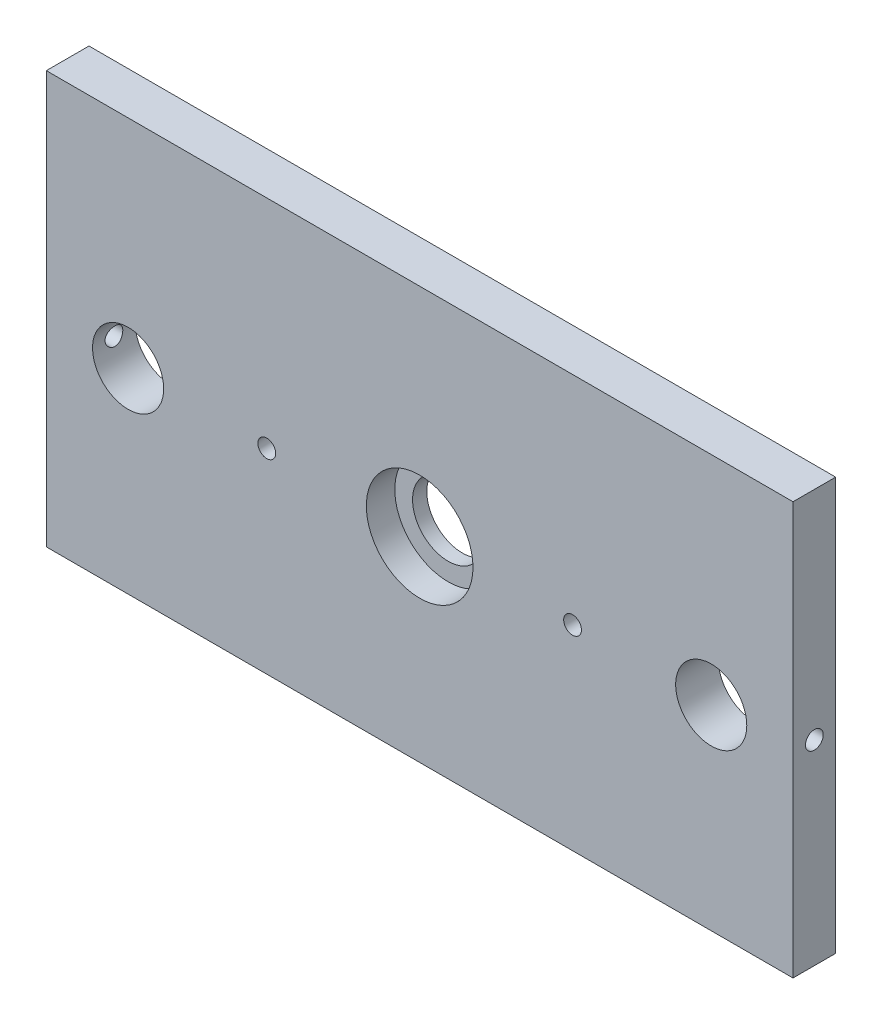
ISO-10303-21;
HEADER;
FILE_DESCRIPTION(('STEP AP214'),'2;1');
FILE_NAME('part.step','',(''),(''),'','','');
FILE_SCHEMA(('AUTOMOTIVE_DESIGN { 1 0 10303 214 1 1 1 1 }'));
ENDSEC;
DATA;
#1=APPLICATION_CONTEXT('core data for automotive mechanical design processes');
#2=APPLICATION_PROTOCOL_DEFINITION('international standard','automotive_design',2000,#1);
#3=PRODUCT_CONTEXT('',#1,'mechanical');
#4=PRODUCT('Part','Part','',(#3));
#5=PRODUCT_RELATED_PRODUCT_CATEGORY('part','',(#4));
#6=PRODUCT_DEFINITION_FORMATION('','',#4);
#7=PRODUCT_DEFINITION_CONTEXT('part definition',#1,'design');
#8=PRODUCT_DEFINITION('design','',#6,#7);
#9=PRODUCT_DEFINITION_SHAPE('','',#8);
#10=(LENGTH_UNIT() NAMED_UNIT(*) SI_UNIT(.MILLI.,.METRE.));
#11=(NAMED_UNIT(*) PLANE_ANGLE_UNIT() SI_UNIT($,.RADIAN.));
#12=(NAMED_UNIT(*) SI_UNIT($,.STERADIAN.) SOLID_ANGLE_UNIT());
#13=UNCERTAINTY_MEASURE_WITH_UNIT(LENGTH_MEASURE(1.E-05),#10,'distance_accuracy_value','');
#14=(GEOMETRIC_REPRESENTATION_CONTEXT(3) GLOBAL_UNCERTAINTY_ASSIGNED_CONTEXT((#13)) GLOBAL_UNIT_ASSIGNED_CONTEXT((#10,
#11,#12)) REPRESENTATION_CONTEXT('',''));
#15=CARTESIAN_POINT('',(0.,0.,0.));
#16=DIRECTION('',(0.,0.,1.));
#17=DIRECTION('',(1.,0.,0.));
#18=AXIS2_PLACEMENT_3D('',#15,#16,#17);
#19=CARTESIAN_POINT('',(105.,55.,-12.));
#20=DIRECTION('',(0.,0.,1.));
#21=DIRECTION('',(1.,0.,0.));
#22=AXIS2_PLACEMENT_3D('',#19,#20,#21);
#23=CYLINDRICAL_SURFACE('',#22,9.99999999999999);
#24=CARTESIAN_POINT('',(105.,55.,-12.));
#25=DIRECTION('',(0.,0.,1.));
#26=DIRECTION('',(1.,0.,0.));
#27=AXIS2_PLACEMENT_3D('',#24,#25,#26);
#28=CIRCLE('',#27,9.99999999999999);
#29=CARTESIAN_POINT('',(115.,55.,-12.));
#30=VERTEX_POINT('',#29);
#31=EDGE_CURVE('E129',#30,#30,#28,.T.);
#32=ORIENTED_EDGE('',*,*,#31,.F.);
#33=EDGE_LOOP('',(#32));
#34=FACE_BOUND('',#33,.T.);
#35=CARTESIAN_POINT('',(105.,55.,-8.));
#36=DIRECTION('',(0.,0.,1.));
#37=DIRECTION('',(1.,0.,0.));
#38=AXIS2_PLACEMENT_3D('',#35,#36,#37);
#39=CIRCLE('',#38,9.99999999999999);
#40=CARTESIAN_POINT('',(115.,55.,-8.));
#41=VERTEX_POINT('',#40);
#42=EDGE_CURVE('E38',#41,#41,#39,.F.);
#43=ORIENTED_EDGE('',*,*,#42,.F.);
#44=EDGE_LOOP('',(#43));
#45=FACE_BOUND('',#44,.T.);
#46=ADVANCED_FACE('F34',(#34,#45),#23,.F.);
#47=CARTESIAN_POINT('',(0.,116.,0.));
#48=DIRECTION('',(1.,0.,0.));
#49=DIRECTION('',(0.,0.,-1.));
#50=AXIS2_PLACEMENT_3D('',#47,#48,#49);
#51=PLANE('',#50);
#52=CARTESIAN_POINT('',(0.,55.,-6.));
#53=DIRECTION('',(-1.,0.,0.));
#54=DIRECTION('',(0.,0.,1.));
#55=AXIS2_PLACEMENT_3D('',#52,#53,#54);
#56=CIRCLE('',#55,2.5);
#57=CARTESIAN_POINT('',(0.,55.,-3.5));
#58=VERTEX_POINT('',#57);
#59=EDGE_CURVE('E136',#58,#58,#56,.T.);
#60=ORIENTED_EDGE('',*,*,#59,.F.);
#61=EDGE_LOOP('',(#60));
#62=FACE_BOUND('',#61,.T.);
#63=DIRECTION('',(0.,0.,1.));
#64=VECTOR('',#63,1.);
#65=CARTESIAN_POINT('',(0.,0.,0.));
#66=LINE('',#65,#64);
#67=CARTESIAN_POINT('',(0.,0.,-12.));
#68=VERTEX_POINT('',#67);
#69=CARTESIAN_POINT('',(0.,0.,0.));
#70=VERTEX_POINT('',#69);
#71=EDGE_CURVE('E150',#68,#70,#66,.T.);
#72=ORIENTED_EDGE('',*,*,#71,.T.);
#73=DIRECTION('',(0.,-1.,0.));
#74=VECTOR('',#73,1.);
#75=CARTESIAN_POINT('',(0.,116.,0.));
#76=LINE('',#75,#74);
#77=CARTESIAN_POINT('',(0.,116.,0.));
#78=VERTEX_POINT('',#77);
#79=EDGE_CURVE('E11',#78,#70,#76,.T.);
#80=ORIENTED_EDGE('',*,*,#79,.F.);
#81=DIRECTION('',(0.,0.,1.));
#82=VECTOR('',#81,1.);
#83=CARTESIAN_POINT('',(0.,116.,0.));
#84=LINE('',#83,#82);
#85=CARTESIAN_POINT('',(0.,116.,-12.));
#86=VERTEX_POINT('',#85);
#87=EDGE_CURVE('E153',#86,#78,#84,.T.);
#88=ORIENTED_EDGE('',*,*,#87,.F.);
#89=DIRECTION('',(0.,-1.,0.));
#90=VECTOR('',#89,1.);
#91=CARTESIAN_POINT('',(0.,116.,-12.));
#92=LINE('',#91,#90);
#93=EDGE_CURVE('E159',#86,#68,#92,.T.);
#94=ORIENTED_EDGE('',*,*,#93,.T.);
#95=EDGE_LOOP('',(#72,#80,#88,#94));
#96=FACE_BOUND('',#95,.T.);
#97=ADVANCED_FACE('F36',(#62,#96),#51,.F.);
#98=CARTESIAN_POINT('',(0.,116.,0.));
#99=DIRECTION('',(0.,0.,-1.));
#100=DIRECTION('',(-1.,0.,0.));
#101=AXIS2_PLACEMENT_3D('',#98,#99,#100);
#102=PLANE('',#101);
#103=CARTESIAN_POINT('',(148.,55.,0.));
#104=DIRECTION('',(0.,0.,-1.));
#105=DIRECTION('',(-1.,0.,0.));
#106=AXIS2_PLACEMENT_3D('',#103,#104,#105);
#107=CIRCLE('',#106,2.49999999999999);
#108=CARTESIAN_POINT('',(145.5,55.,0.));
#109=VERTEX_POINT('',#108);
#110=EDGE_CURVE('E253',#109,#109,#107,.T.);
#111=ORIENTED_EDGE('',*,*,#110,.T.);
#112=EDGE_LOOP('',(#111));
#113=FACE_BOUND('',#112,.T.);
#114=CARTESIAN_POINT('',(62.,55.,0.));
#115=DIRECTION('',(0.,0.,-1.));
#116=DIRECTION('',(-1.,0.,0.));
#117=AXIS2_PLACEMENT_3D('',#114,#115,#116);
#118=CIRCLE('',#117,2.49999999999999);
#119=CARTESIAN_POINT('',(59.5,55.,0.));
#120=VERTEX_POINT('',#119);
#121=EDGE_CURVE('E111',#120,#120,#118,.T.);
#122=ORIENTED_EDGE('',*,*,#121,.T.);
#123=EDGE_LOOP('',(#122));
#124=FACE_BOUND('',#123,.T.);
#125=CARTESIAN_POINT('',(105.,55.,0.));
#126=DIRECTION('',(0.,0.,1.));
#127=DIRECTION('',(1.,0.,0.));
#128=AXIS2_PLACEMENT_3D('',#125,#126,#127);
#129=CIRCLE('',#128,15.);
#130=CARTESIAN_POINT('',(120.,55.,0.));
#131=VERTEX_POINT('',#130);
#132=EDGE_CURVE('E123',#131,#131,#129,.T.);
#133=ORIENTED_EDGE('',*,*,#132,.F.);
#134=EDGE_LOOP('',(#133));
#135=FACE_BOUND('',#134,.T.);
#136=CARTESIAN_POINT('',(187.,55.,0.));
#137=DIRECTION('',(0.,0.,1.));
#138=DIRECTION('',(1.,0.,0.));
#139=AXIS2_PLACEMENT_3D('',#136,#137,#138);
#140=CIRCLE('',#139,10.);
#141=CARTESIAN_POINT('',(197.,55.,0.));
#142=VERTEX_POINT('',#141);
#143=EDGE_CURVE('E144',#142,#142,#140,.T.);
#144=ORIENTED_EDGE('',*,*,#143,.F.);
#145=EDGE_LOOP('',(#144));
#146=FACE_BOUND('',#145,.T.);
#147=CARTESIAN_POINT('',(23.,55.,0.));
#148=DIRECTION('',(0.,0.,1.));
#149=DIRECTION('',(1.,0.,0.));
#150=AXIS2_PLACEMENT_3D('',#147,#148,#149);
#151=CIRCLE('',#150,10.);
#152=CARTESIAN_POINT('',(33.,55.,0.));
#153=VERTEX_POINT('',#152);
#154=EDGE_CURVE('E143',#153,#153,#151,.T.);
#155=ORIENTED_EDGE('',*,*,#154,.F.);
#156=EDGE_LOOP('',(#155));
#157=FACE_BOUND('',#156,.T.);
#158=DIRECTION('',(1.,0.,0.));
#159=VECTOR('',#158,1.);
#160=CARTESIAN_POINT('',(0.,0.,0.));
#161=LINE('',#160,#159);
#162=CARTESIAN_POINT('',(210.,0.,0.));
#163=VERTEX_POINT('',#162);
#164=EDGE_CURVE('E162',#70,#163,#161,.T.);
#165=ORIENTED_EDGE('',*,*,#164,.T.);
#166=DIRECTION('',(0.,-1.,0.));
#167=VECTOR('',#166,1.);
#168=CARTESIAN_POINT('',(210.,116.,0.));
#169=LINE('',#168,#167);
#170=CARTESIAN_POINT('',(210.,116.,0.));
#171=VERTEX_POINT('',#170);
#172=EDGE_CURVE('E44',#171,#163,#169,.T.);
#173=ORIENTED_EDGE('',*,*,#172,.F.);
#174=DIRECTION('',(1.,0.,0.));
#175=VECTOR('',#174,1.);
#176=CARTESIAN_POINT('',(0.,116.,0.));
#177=LINE('',#176,#175);
#178=EDGE_CURVE('E84',#78,#171,#177,.T.);
#179=ORIENTED_EDGE('',*,*,#178,.F.);
#180=ORIENTED_EDGE('',*,*,#79,.T.);
#181=EDGE_LOOP('',(#165,#173,#179,#180));
#182=FACE_BOUND('',#181,.T.);
#183=ADVANCED_FACE('F208',(#113,#124,#135,#146,#157,#182),#102,.F.);
#184=CARTESIAN_POINT('',(210.,116.,0.));
#185=DIRECTION('',(-1.,0.,0.));
#186=DIRECTION('',(0.,0.,1.));
#187=AXIS2_PLACEMENT_3D('',#184,#185,#186);
#188=PLANE('',#187);
#189=CARTESIAN_POINT('',(210.,55.,-6.));
#190=DIRECTION('',(1.,0.,0.));
#191=DIRECTION('',(0.,0.,-1.));
#192=AXIS2_PLACEMENT_3D('',#189,#190,#191);
#193=CIRCLE('',#192,2.49999999999999);
#194=CARTESIAN_POINT('',(210.,55.,-8.49999999999999));
#195=VERTEX_POINT('',#194);
#196=EDGE_CURVE('E132',#195,#195,#193,.T.);
#197=ORIENTED_EDGE('',*,*,#196,.F.);
#198=EDGE_LOOP('',(#197));
#199=FACE_BOUND('',#198,.T.);
#200=DIRECTION('',(0.,0.,-1.));
#201=VECTOR('',#200,1.);
#202=CARTESIAN_POINT('',(210.,0.,0.));
#203=LINE('',#202,#201);
#204=CARTESIAN_POINT('',(210.,0.,-12.));
#205=VERTEX_POINT('',#204);
#206=EDGE_CURVE('E71',#163,#205,#203,.T.);
#207=ORIENTED_EDGE('',*,*,#206,.T.);
#208=DIRECTION('',(0.,-1.,0.));
#209=VECTOR('',#208,1.);
#210=CARTESIAN_POINT('',(210.,116.,-12.));
#211=LINE('',#210,#209);
#212=CARTESIAN_POINT('',(210.,116.,-12.));
#213=VERTEX_POINT('',#212);
#214=EDGE_CURVE('E167',#213,#205,#211,.T.);
#215=ORIENTED_EDGE('',*,*,#214,.F.);
#216=DIRECTION('',(0.,0.,-1.));
#217=VECTOR('',#216,1.);
#218=CARTESIAN_POINT('',(210.,116.,0.));
#219=LINE('',#218,#217);
#220=EDGE_CURVE('E156',#171,#213,#219,.T.);
#221=ORIENTED_EDGE('',*,*,#220,.F.);
#222=ORIENTED_EDGE('',*,*,#172,.T.);
#223=EDGE_LOOP('',(#207,#215,#221,#222));
#224=FACE_BOUND('',#223,.T.);
#225=ADVANCED_FACE('F266',(#199,#224),#188,.F.);
#226=CARTESIAN_POINT('',(0.,116.,-12.));
#227=DIRECTION('',(0.,0.,1.));
#228=DIRECTION('',(1.,0.,0.));
#229=AXIS2_PLACEMENT_3D('',#226,#227,#228);
#230=PLANE('',#229);
#231=CARTESIAN_POINT('',(148.,55.,-12.));
#232=DIRECTION('',(0.,0.,-1.));
#233=DIRECTION('',(-1.,0.,0.));
#234=AXIS2_PLACEMENT_3D('',#231,#232,#233);
#235=CIRCLE('',#234,2.5);
#236=CARTESIAN_POINT('',(145.5,55.,-12.));
#237=VERTEX_POINT('',#236);
#238=EDGE_CURVE('E250',#237,#237,#235,.T.);
#239=ORIENTED_EDGE('',*,*,#238,.F.);
#240=EDGE_LOOP('',(#239));
#241=FACE_BOUND('',#240,.T.);
#242=CARTESIAN_POINT('',(62.,55.,-12.));
#243=DIRECTION('',(0.,0.,-1.));
#244=DIRECTION('',(-1.,0.,0.));
#245=AXIS2_PLACEMENT_3D('',#242,#243,#244);
#246=CIRCLE('',#245,2.49999999999999);
#247=CARTESIAN_POINT('',(59.5,55.,-12.));
#248=VERTEX_POINT('',#247);
#249=EDGE_CURVE('E255',#248,#248,#246,.T.);
#250=ORIENTED_EDGE('',*,*,#249,.F.);
#251=EDGE_LOOP('',(#250));
#252=FACE_BOUND('',#251,.T.);
#253=ORIENTED_EDGE('',*,*,#31,.T.);
#254=EDGE_LOOP('',(#253));
#255=FACE_BOUND('',#254,.T.);
#256=CARTESIAN_POINT('',(187.,55.,-12.));
#257=DIRECTION('',(0.,0.,1.));
#258=DIRECTION('',(1.,0.,0.));
#259=AXIS2_PLACEMENT_3D('',#256,#257,#258);
#260=CIRCLE('',#259,10.);
#261=CARTESIAN_POINT('',(197.,55.,-12.));
#262=VERTEX_POINT('',#261);
#263=EDGE_CURVE('E140',#262,#262,#260,.T.);
#264=ORIENTED_EDGE('',*,*,#263,.T.);
#265=EDGE_LOOP('',(#264));
#266=FACE_BOUND('',#265,.T.);
#267=CARTESIAN_POINT('',(23.,55.,-12.));
#268=DIRECTION('',(0.,0.,1.));
#269=DIRECTION('',(1.,0.,0.));
#270=AXIS2_PLACEMENT_3D('',#267,#268,#269);
#271=CIRCLE('',#270,10.);
#272=CARTESIAN_POINT('',(33.,55.,-12.));
#273=VERTEX_POINT('',#272);
#274=EDGE_CURVE('E147',#273,#273,#271,.T.);
#275=ORIENTED_EDGE('',*,*,#274,.T.);
#276=EDGE_LOOP('',(#275));
#277=FACE_BOUND('',#276,.T.);
#278=DIRECTION('',(-1.,0.,0.));
#279=VECTOR('',#278,1.);
#280=CARTESIAN_POINT('',(0.,0.,-12.));
#281=LINE('',#280,#279);
#282=EDGE_CURVE('E77',#205,#68,#281,.T.);
#283=ORIENTED_EDGE('',*,*,#282,.T.);
#284=ORIENTED_EDGE('',*,*,#93,.F.);
#285=DIRECTION('',(-1.,0.,0.));
#286=VECTOR('',#285,1.);
#287=CARTESIAN_POINT('',(0.,116.,-12.));
#288=LINE('',#287,#286);
#289=EDGE_CURVE('E53',#213,#86,#288,.T.);
#290=ORIENTED_EDGE('',*,*,#289,.F.);
#291=ORIENTED_EDGE('',*,*,#214,.T.);
#292=EDGE_LOOP('',(#283,#284,#290,#291));
#293=FACE_BOUND('',#292,.T.);
#294=ADVANCED_FACE('F278',(#241,#252,#255,#266,#277,#293),#230,.F.);
#295=CARTESIAN_POINT('',(0.,116.,0.));
#296=DIRECTION('',(0.,-1.,0.));
#297=DIRECTION('',(0.,0.,-1.));
#298=AXIS2_PLACEMENT_3D('',#295,#296,#297);
#299=PLANE('',#298);
#300=ORIENTED_EDGE('',*,*,#87,.T.);
#301=ORIENTED_EDGE('',*,*,#178,.T.);
#302=ORIENTED_EDGE('',*,*,#220,.T.);
#303=ORIENTED_EDGE('',*,*,#289,.T.);
#304=EDGE_LOOP('',(#300,#301,#302,#303));
#305=FACE_BOUND('',#304,.T.);
#306=ADVANCED_FACE('F280',(#305),#299,.F.);
#307=CARTESIAN_POINT('',(0.,0.,0.));
#308=DIRECTION('',(0.,-1.,0.));
#309=DIRECTION('',(0.,0.,-1.));
#310=AXIS2_PLACEMENT_3D('',#307,#308,#309);
#311=PLANE('',#310);
#312=CARTESIAN_POINT('',(25.,0.,-6.));
#313=DIRECTION('',(0.,-1.,0.));
#314=DIRECTION('',(0.,0.,-1.));
#315=AXIS2_PLACEMENT_3D('',#312,#313,#314);
#316=CIRCLE('',#315,2.49999999999999);
#317=CARTESIAN_POINT('',(25.,0.,-8.49999999999999));
#318=VERTEX_POINT('',#317);
#319=EDGE_CURVE('E105',#318,#318,#316,.T.);
#320=ORIENTED_EDGE('',*,*,#319,.F.);
#321=EDGE_LOOP('',(#320));
#322=FACE_BOUND('',#321,.T.);
#323=CARTESIAN_POINT('',(105.,0.,-6.));
#324=DIRECTION('',(0.,-1.,0.));
#325=DIRECTION('',(0.,0.,-1.));
#326=AXIS2_PLACEMENT_3D('',#323,#324,#325);
#327=CIRCLE('',#326,2.49999999999999);
#328=CARTESIAN_POINT('',(105.,0.,-8.49999999999999));
#329=VERTEX_POINT('',#328);
#330=EDGE_CURVE('E104',#329,#329,#327,.T.);
#331=ORIENTED_EDGE('',*,*,#330,.F.);
#332=EDGE_LOOP('',(#331));
#333=FACE_BOUND('',#332,.T.);
#334=CARTESIAN_POINT('',(185.,0.,-6.));
#335=DIRECTION('',(0.,-1.,0.));
#336=DIRECTION('',(0.,0.,-1.));
#337=AXIS2_PLACEMENT_3D('',#334,#335,#336);
#338=CIRCLE('',#337,2.5);
#339=CARTESIAN_POINT('',(185.,0.,-8.5));
#340=VERTEX_POINT('',#339);
#341=EDGE_CURVE('E117',#340,#340,#338,.T.);
#342=ORIENTED_EDGE('',*,*,#341,.F.);
#343=EDGE_LOOP('',(#342));
#344=FACE_BOUND('',#343,.T.);
#345=ORIENTED_EDGE('',*,*,#71,.F.);
#346=ORIENTED_EDGE('',*,*,#282,.F.);
#347=ORIENTED_EDGE('',*,*,#206,.F.);
#348=ORIENTED_EDGE('',*,*,#164,.F.);
#349=EDGE_LOOP('',(#345,#346,#347,#348));
#350=FACE_BOUND('',#349,.T.);
#351=ADVANCED_FACE('F198',(#322,#333,#344,#350),#311,.T.);
#352=CARTESIAN_POINT('',(23.,55.,-12.));
#353=DIRECTION('',(0.,0.,1.));
#354=DIRECTION('',(1.,0.,0.));
#355=AXIS2_PLACEMENT_3D('',#352,#353,#354);
#356=CYLINDRICAL_SURFACE('',#355,10.);
#357=CARTESIAN_POINT('',(13.,55.,-3.5));
#358=CARTESIAN_POINT('',(13.0000023355331,55.1381268144495,-3.50000387623027));
#359=CARTESIAN_POINT('',(13.0028903644696,55.2762969297179,-3.51148591795631));
#360=CARTESIAN_POINT('',(13.0141314361684,55.5486772062842,-3.55704191884501));
#361=CARTESIAN_POINT('',(13.0224875763337,55.6828850781179,-3.59112868256309));
#362=CARTESIAN_POINT('',(13.0437395611328,55.9433681203043,-3.68073208910348));
#363=CARTESIAN_POINT('',(13.0566299526324,56.0696526057167,-3.73622299785878));
#364=CARTESIAN_POINT('',(13.0855776032063,56.3111202198407,-3.86696898340807));
#365=CARTESIAN_POINT('',(13.1016349690974,56.4263029739146,-3.94222472686495));
#366=CARTESIAN_POINT('',(13.1355431068051,56.6446698788349,-4.1120013160903));
#367=CARTESIAN_POINT('',(13.1534215475312,56.7475928167684,-4.20685262493176));
#368=CARTESIAN_POINT('',(13.1887729980344,56.9362482120055,-4.41242034151505));
#369=CARTESIAN_POINT('',(13.2062459618355,57.0219787282486,-4.52313853824489));
#370=CARTESIAN_POINT('',(13.2390870716972,57.1750442379983,-4.75932537789498));
#371=CARTESIAN_POINT('',(13.2544200922531,57.2420870265419,-4.88498871801454));
#372=CARTESIAN_POINT('',(13.2808417530331,57.3539948475846,-5.14624735276672));
#373=CARTESIAN_POINT('',(13.2919310717597,57.3988634257336,-5.28184105555336));
#374=CARTESIAN_POINT('',(13.3083253883946,57.4642580613413,-5.55623916366943));
#375=CARTESIAN_POINT('',(13.3137418167165,57.4852537805534,-5.69492482672998));
#376=CARTESIAN_POINT('',(13.3185106256735,57.5037696251107,-5.97394761499891));
#377=CARTESIAN_POINT('',(13.3178639928679,57.5012935696969,-6.11428446782023));
#378=CARTESIAN_POINT('',(13.310679908053,57.4733108743995,-6.38902634624225));
#379=CARTESIAN_POINT('',(13.3042856165451,57.4483639003177,-6.52349270244221));
#380=CARTESIAN_POINT('',(13.2865548388155,57.377040311505,-6.78626841818509));
#381=CARTESIAN_POINT('',(13.2752180005127,57.3306621701157,-6.91457733838153));
#382=CARTESIAN_POINT('',(13.2487481015723,57.217315796562,-7.16289669375354));
#383=CARTESIAN_POINT('',(13.2335778755031,57.1501444453882,-7.28281028631594));
#384=CARTESIAN_POINT('',(13.2011714859001,56.9972604600249,-7.50986451626136));
#385=CARTESIAN_POINT('',(13.1839349610895,56.9115445813481,-7.61700291344541));
#386=CARTESIAN_POINT('',(13.1487353243351,56.721105707802,-7.81867269282401));
#387=CARTESIAN_POINT('',(13.1307655087,56.6159104302764,-7.91275748343558));
#388=CARTESIAN_POINT('',(13.0965672403541,56.3910198625062,-8.0820354041065));
#389=CARTESIAN_POINT('',(13.0803388408432,56.2713241295132,-8.15722795710594));
#390=CARTESIAN_POINT('',(13.0513711317635,56.0201931478023,-8.28675097704064));
#391=CARTESIAN_POINT('',(13.0386439978712,55.888718988681,-8.34100890042404));
#392=CARTESIAN_POINT('',(13.0182013834764,55.6181266802381,-8.42652884284929));
#393=CARTESIAN_POINT('',(13.0104849443453,55.4790099985841,-8.4577952606969));
#394=CARTESIAN_POINT('',(13.0010750121438,55.20089995065,-8.49576260926473));
#395=CARTESIAN_POINT('',(12.9992324415287,55.0619945333137,-8.5030717101255));
#396=CARTESIAN_POINT('',(13.0013532530925,54.7849452086641,-8.49458499657418));
#397=CARTESIAN_POINT('',(13.0053161126358,54.6468012339257,-8.47879126200143));
#398=CARTESIAN_POINT('',(13.0185069812108,54.3773095520392,-8.42504848601437));
#399=CARTESIAN_POINT('',(13.0276560969035,54.2458914683854,-8.38743122753838));
#400=CARTESIAN_POINT('',(13.050188222764,53.9912378459125,-8.2914881932859));
#401=CARTESIAN_POINT('',(13.0635716605003,53.8680031349456,-8.23316032614463));
#402=CARTESIAN_POINT('',(13.0934448678963,53.6307947759503,-8.09627311854221));
#403=CARTESIAN_POINT('',(13.10998554389,53.5170242636071,-8.01737314600573));
#404=CARTESIAN_POINT('',(13.1442581802041,53.3041223105945,-7.84201681867139));
#405=CARTESIAN_POINT('',(13.1619903457842,53.2049934017113,-7.74555743397059));
#406=CARTESIAN_POINT('',(13.197184050675,53.0216823865459,-7.53499673192716));
#407=CARTESIAN_POINT('',(13.2146282636254,52.9379268872982,-7.42052049500073));
#408=CARTESIAN_POINT('',(13.2467853602993,52.790815401644,-7.17877894255237));
#409=CARTESIAN_POINT('',(13.2614983652506,52.727458509731,-7.05151419504927));
#410=CARTESIAN_POINT('',(13.2863650880533,52.6234142989878,-6.78849046265628));
#411=CARTESIAN_POINT('',(13.2965457462419,52.5825926722607,-6.65278728614618));
#412=CARTESIAN_POINT('',(13.3112209329341,52.5244239000951,-6.37615060357451));
#413=CARTESIAN_POINT('',(13.3157167049596,52.5070716208735,-6.23521824829759));
#414=CARTESIAN_POINT('',(13.3184183129839,52.4966023494392,-5.95646496023066));
#415=CARTESIAN_POINT('',(13.3168011211197,52.5028035036987,-5.81867094145593));
#416=CARTESIAN_POINT('',(13.3078681832786,52.5377045361463,-5.54616018555623));
#417=CARTESIAN_POINT('',(13.3005525518227,52.566403962189,-5.41144338664468));
#418=CARTESIAN_POINT('',(13.2811456552678,52.6451144675951,-5.14965256822356));
#419=CARTESIAN_POINT('',(13.2690830793894,52.694997658866,-5.02253782459945));
#420=CARTESIAN_POINT('',(13.2415374045916,52.814558477325,-4.77839102881072));
#421=CARTESIAN_POINT('',(13.2260538313219,52.884238849943,-4.66136037802186));
#422=CARTESIAN_POINT('',(13.1929060956066,53.0435537522714,-4.43740895166324));
#423=CARTESIAN_POINT('',(13.175195586137,53.1336613951462,-4.33083154429339));
#424=CARTESIAN_POINT('',(13.1398662125623,53.3303510480171,-4.13408825867434));
#425=CARTESIAN_POINT('',(13.1222473712158,53.4369369645648,-4.04392628314506));
#426=CARTESIAN_POINT('',(13.0887057392055,53.6658873554957,-3.88098115239232));
#427=CARTESIAN_POINT('',(13.0728194439022,53.7885026294727,-3.80854231054737));
#428=CARTESIAN_POINT('',(13.0449179170814,54.0445565674825,-3.68542089509912));
#429=CARTESIAN_POINT('',(13.032899913337,54.1779873942721,-3.63472273225244));
#430=CARTESIAN_POINT('',(13.0158656739076,54.4259829112609,-3.56404694945058));
#431=CARTESIAN_POINT('',(13.0099569157885,54.5393663818199,-3.54008126157761));
#432=CARTESIAN_POINT('',(13.0020232461342,54.7684898807729,-3.5080567606301));
#433=CARTESIAN_POINT('',(12.9999980424851,54.8842297312623,-3.49999675115783));
#434=CARTESIAN_POINT('',(13.,55.,-3.5));
#435=B_SPLINE_CURVE_WITH_KNOTS('',3,(#357,#358,#359,#360,#361,#362,#363,#364,#365,#366,#367,
#368,#369,#370,#371,#372,#373,#374,#375,#376,#377,#378,#379,#380,#381,#382,#383,#384,#385,#386,
#387,#388,#389,#390,#391,#392,#393,#394,#395,#396,#397,#398,#399,#400,#401,#402,#403,#404,#405,
#406,#407,#408,#409,#410,#411,#412,#413,#414,#415,#416,#417,#418,#419,#420,#421,#422,#423,#424,
#425,#426,#427,#428,#429,#430,#431,#432,#433,#434),.UNSPECIFIED.,.T.,.F.,(4,2,2,2,2,2,2,2,2,2,2,
2,2,2,2,2,2,2,2,2,2,2,2,2,2,2,2,2,2,2,2,2,2,2,2,2,2,2,4),(0.,0.413956187453143,
0.828147062939829,1.24184150381018,1.65554990028221,2.07690725728564,2.49831215966769,
2.92597745909678,3.3535743528228,3.77260491835116,4.19156730193362,4.60037495017231,
5.00921172448931,5.42217546461999,5.83521151399138,6.26002501620566,6.68485149269279,
7.11113715020724,7.53734122819939,7.95263848254329,8.36789835193439,8.77700457528929,
9.18615212209351,9.60255979281121,10.0190393835223,10.4457418201299,10.8724253125471,
11.2965375769763,11.7205570543048,12.1323963400748,12.5442273493652,12.9536066760887,
13.3630428023796,13.7831596069298,14.2033761629382,14.6312030917578,15.0587227304538,
15.4057040491338,15.7526592674819),.UNSPECIFIED.);
#436=CARTESIAN_POINT('',(13.,55.,-3.5));
#437=VERTEX_POINT('',#436);
#438=EDGE_CURVE('E139',#437,#437,#435,.T.);
#439=ORIENTED_EDGE('',*,*,#438,.T.);
#440=EDGE_LOOP('',(#439));
#441=FACE_BOUND('',#440,.T.);
#442=ORIENTED_EDGE('',*,*,#274,.F.);
#443=EDGE_LOOP('',(#442));
#444=FACE_BOUND('',#443,.T.);
#445=ORIENTED_EDGE('',*,*,#154,.T.);
#446=EDGE_LOOP('',(#445));
#447=FACE_BOUND('',#446,.T.);
#448=ADVANCED_FACE('F179',(#441,#444,#447),#356,.F.);
#449=CARTESIAN_POINT('',(187.,55.,-12.));
#450=DIRECTION('',(0.,0.,1.));
#451=DIRECTION('',(1.,0.,0.));
#452=AXIS2_PLACEMENT_3D('',#449,#450,#451);
#453=CYLINDRICAL_SURFACE('',#452,10.);
#454=CARTESIAN_POINT('',(197.,55.,-8.49999999999999));
#455=CARTESIAN_POINT('',(196.999997664467,55.1381268144495,-8.49999612376973));
#456=CARTESIAN_POINT('',(196.99710963553,55.2762969297179,-8.48851408204368));
#457=CARTESIAN_POINT('',(196.985868563832,55.5486772062842,-8.44295808115498));
#458=CARTESIAN_POINT('',(196.977512423666,55.6828850781179,-8.40887131743691));
#459=CARTESIAN_POINT('',(196.956260438867,55.9433681203043,-8.31926791089652));
#460=CARTESIAN_POINT('',(196.943370047368,56.0696526057167,-8.26377700214121));
#461=CARTESIAN_POINT('',(196.914422396794,56.3111202198407,-8.13303101659192));
#462=CARTESIAN_POINT('',(196.898365030903,56.4263029739146,-8.05777527313505));
#463=CARTESIAN_POINT('',(196.864456893195,56.6446698788349,-7.88799868390969));
#464=CARTESIAN_POINT('',(196.846578452469,56.7475928167684,-7.79314737506823));
#465=CARTESIAN_POINT('',(196.811227001966,56.9362482120055,-7.58757965848494));
#466=CARTESIAN_POINT('',(196.793754038164,57.0219787282486,-7.47686146175511));
#467=CARTESIAN_POINT('',(196.760912928303,57.1750442379983,-7.24067462210502));
#468=CARTESIAN_POINT('',(196.745579907747,57.2420870265419,-7.11501128198545));
#469=CARTESIAN_POINT('',(196.719158246967,57.3539948475846,-6.85375264723327));
#470=CARTESIAN_POINT('',(196.70806892824,57.3988634257336,-6.71815894444664));
#471=CARTESIAN_POINT('',(196.691674611605,57.4642580613413,-6.44376083633056));
#472=CARTESIAN_POINT('',(196.686258183284,57.4852537805534,-6.30507517327001));
#473=CARTESIAN_POINT('',(196.681489374327,57.5037696251107,-6.02605238500109));
#474=CARTESIAN_POINT('',(196.682136007132,57.5012935696968,-5.88571553217977));
#475=CARTESIAN_POINT('',(196.689320091947,57.4733108743995,-5.61097365375775));
#476=CARTESIAN_POINT('',(196.695714383455,57.4483639003177,-5.47650729755778));
#477=CARTESIAN_POINT('',(196.713445161184,57.377040311505,-5.2137315818149));
#478=CARTESIAN_POINT('',(196.724781999487,57.3306621701156,-5.08542266161847));
#479=CARTESIAN_POINT('',(196.751251898428,57.217315796562,-4.83710330624645));
#480=CARTESIAN_POINT('',(196.766422124497,57.1501444453882,-4.71718971368405));
#481=CARTESIAN_POINT('',(196.7988285141,56.9972604600249,-4.49013548373863));
#482=CARTESIAN_POINT('',(196.81606503891,56.9115445813481,-4.38299708655458));
#483=CARTESIAN_POINT('',(196.851264675665,56.721105707802,-4.181327307176));
#484=CARTESIAN_POINT('',(196.8692344913,56.6159104302764,-4.08724251656442));
#485=CARTESIAN_POINT('',(196.903432759646,56.3910198625062,-3.9179645958935));
#486=CARTESIAN_POINT('',(196.919661159157,56.2713241295132,-3.84277204289406));
#487=CARTESIAN_POINT('',(196.948628868237,56.0201931478023,-3.71324902295936));
#488=CARTESIAN_POINT('',(196.961356002129,55.888718988681,-3.65899109957596));
#489=CARTESIAN_POINT('',(196.981798616524,55.6181266802381,-3.57347115715072));
#490=CARTESIAN_POINT('',(196.989515055655,55.4790099985841,-3.54220473930311));
#491=CARTESIAN_POINT('',(196.998924987856,55.20089995065,-3.50423739073528));
#492=CARTESIAN_POINT('',(197.000767558471,55.0619945333137,-3.4969282898745));
#493=CARTESIAN_POINT('',(196.998646746908,54.7849452086641,-3.50541500342582));
#494=CARTESIAN_POINT('',(196.994683887364,54.6468012339257,-3.52120873799857));
#495=CARTESIAN_POINT('',(196.981493018789,54.3773095520392,-3.57495151398563));
#496=CARTESIAN_POINT('',(196.972343903096,54.2458914683854,-3.61256877246163));
#497=CARTESIAN_POINT('',(196.949811777236,53.9912378459125,-3.70851180671411));
#498=CARTESIAN_POINT('',(196.9364283395,53.8680031349456,-3.76683967385538));
#499=CARTESIAN_POINT('',(196.906555132104,53.6307947759503,-3.9037268814578));
#500=CARTESIAN_POINT('',(196.89001445611,53.5170242636071,-3.98262685399428));
#501=CARTESIAN_POINT('',(196.855741819796,53.3041223105945,-4.15798318132862));
#502=CARTESIAN_POINT('',(196.838009654216,53.2049934017113,-4.25444256602942));
#503=CARTESIAN_POINT('',(196.802815949325,53.0216823865459,-4.46500326807285));
#504=CARTESIAN_POINT('',(196.785371736375,52.9379268872982,-4.57947950499927));
#505=CARTESIAN_POINT('',(196.753214639701,52.790815401644,-4.82122105744764));
#506=CARTESIAN_POINT('',(196.738501634749,52.727458509731,-4.94848580495074));
#507=CARTESIAN_POINT('',(196.713634911947,52.6234142989878,-5.21150953734373));
#508=CARTESIAN_POINT('',(196.703454253758,52.5825926722607,-5.34721271385383));
#509=CARTESIAN_POINT('',(196.688779067066,52.5244239000951,-5.62384939642549));
#510=CARTESIAN_POINT('',(196.68428329504,52.5070716208735,-5.76478175170242));
#511=CARTESIAN_POINT('',(196.681581687016,52.4966023494392,-6.04353503976935));
#512=CARTESIAN_POINT('',(196.68319887888,52.5028035036987,-6.18132905854408));
#513=CARTESIAN_POINT('',(196.692131816721,52.5377045361464,-6.45383981444378));
#514=CARTESIAN_POINT('',(196.699447448177,52.566403962189,-6.58855661335532));
#515=CARTESIAN_POINT('',(196.718854344732,52.6451144675951,-6.85034743177644));
#516=CARTESIAN_POINT('',(196.730916920611,52.694997658866,-6.97746217540055));
#517=CARTESIAN_POINT('',(196.758462595408,52.814558477325,-7.22160897118928));
#518=CARTESIAN_POINT('',(196.773946168678,52.884238849943,-7.33863962197814));
#519=CARTESIAN_POINT('',(196.807093904393,53.0435537522714,-7.56259104833675));
#520=CARTESIAN_POINT('',(196.824804413863,53.1336613951462,-7.66916845570661));
#521=CARTESIAN_POINT('',(196.860133787438,53.3303510480171,-7.86591174132565));
#522=CARTESIAN_POINT('',(196.877752628784,53.4369369645648,-7.95607371685494));
#523=CARTESIAN_POINT('',(196.911294260794,53.6658873554957,-8.11901884760767));
#524=CARTESIAN_POINT('',(196.927180556098,53.7885026294727,-8.19145768945262));
#525=CARTESIAN_POINT('',(196.955082082919,54.0445565674825,-8.31457910490087));
#526=CARTESIAN_POINT('',(196.967100086663,54.1779873942721,-8.36527726774755));
#527=CARTESIAN_POINT('',(196.984134326092,54.4259829112609,-8.43595305054941));
#528=CARTESIAN_POINT('',(196.990043084212,54.5393663818199,-8.45991873842238));
#529=CARTESIAN_POINT('',(196.997976753866,54.7684898807729,-8.4919432393699));
#530=CARTESIAN_POINT('',(197.000001957515,54.8842297312623,-8.50000324884216));
#531=CARTESIAN_POINT('',(197.,55.,-8.49999999999999));
#532=B_SPLINE_CURVE_WITH_KNOTS('',3,(#454,#455,#456,#457,#458,#459,#460,#461,#462,#463,#464,
#465,#466,#467,#468,#469,#470,#471,#472,#473,#474,#475,#476,#477,#478,#479,#480,#481,#482,#483,
#484,#485,#486,#487,#488,#489,#490,#491,#492,#493,#494,#495,#496,#497,#498,#499,#500,#501,#502,
#503,#504,#505,#506,#507,#508,#509,#510,#511,#512,#513,#514,#515,#516,#517,#518,#519,#520,#521,
#522,#523,#524,#525,#526,#527,#528,#529,#530,#531),.UNSPECIFIED.,.T.,.F.,(4,2,2,2,2,2,2,2,2,2,2,
2,2,2,2,2,2,2,2,2,2,2,2,2,2,2,2,2,2,2,2,2,2,2,2,2,2,2,4),(0.,0.413956187453143,
0.828147062939829,1.24184150381018,1.65554990028221,2.07690725728563,2.49831215966768,
2.92597745909677,3.35357435282279,3.77260491835115,4.19156730193361,4.6003749501723,
5.00921172448931,5.42217546461998,5.83521151399137,6.26002501620565,6.68485149269278,
7.11113715020722,7.53734122819937,7.95263848254326,8.36789835193437,8.77700457528927,
9.18615212209348,9.60255979281118,10.0190393835223,10.4457418201299,10.8724253125471,
11.2965375769763,11.7205570543047,12.1323963400748,12.5442273493652,12.9536066760887,
13.3630428023796,13.7831596069298,14.2033761629382,14.6312030917577,15.0587227304538,
15.4057040491337,15.7526592674819),.UNSPECIFIED.);
#533=CARTESIAN_POINT('',(197.,55.,-8.49999999999999));
#534=VERTEX_POINT('',#533);
#535=EDGE_CURVE('E135',#534,#534,#532,.T.);
#536=ORIENTED_EDGE('',*,*,#535,.T.);
#537=EDGE_LOOP('',(#536));
#538=FACE_BOUND('',#537,.T.);
#539=ORIENTED_EDGE('',*,*,#263,.F.);
#540=EDGE_LOOP('',(#539));
#541=FACE_BOUND('',#540,.T.);
#542=ORIENTED_EDGE('',*,*,#143,.T.);
#543=EDGE_LOOP('',(#542));
#544=FACE_BOUND('',#543,.T.);
#545=ADVANCED_FACE('F186',(#538,#541,#544),#453,.F.);
#546=CARTESIAN_POINT('',(0.,55.,-6.));
#547=DIRECTION('',(-1.,0.,0.));
#548=DIRECTION('',(0.,0.,1.));
#549=AXIS2_PLACEMENT_3D('',#546,#547,#548);
#550=CYLINDRICAL_SURFACE('',#549,2.5);
#551=ORIENTED_EDGE('',*,*,#59,.T.);
#552=EDGE_LOOP('',(#551));
#553=FACE_BOUND('',#552,.T.);
#554=ORIENTED_EDGE('',*,*,#438,.F.);
#555=EDGE_LOOP('',(#554));
#556=FACE_BOUND('',#555,.T.);
#557=ADVANCED_FACE('F182',(#553,#556),#550,.F.);
#558=CARTESIAN_POINT('',(210.,55.,-6.));
#559=DIRECTION('',(1.,0.,0.));
#560=DIRECTION('',(0.,0.,-1.));
#561=AXIS2_PLACEMENT_3D('',#558,#559,#560);
#562=CYLINDRICAL_SURFACE('',#561,2.49999999999999);
#563=ORIENTED_EDGE('',*,*,#196,.T.);
#564=EDGE_LOOP('',(#563));
#565=FACE_BOUND('',#564,.T.);
#566=ORIENTED_EDGE('',*,*,#535,.F.);
#567=EDGE_LOOP('',(#566));
#568=FACE_BOUND('',#567,.T.);
#569=ADVANCED_FACE('F185',(#565,#568),#562,.F.);
#570=CARTESIAN_POINT('',(105.,55.,-8.));
#571=DIRECTION('',(0.,0.,1.));
#572=DIRECTION('',(1.,0.,0.));
#573=AXIS2_PLACEMENT_3D('',#570,#571,#572);
#574=PLANE('',#573);
#575=CARTESIAN_POINT('',(105.,55.,-8.));
#576=DIRECTION('',(0.,0.,1.));
#577=DIRECTION('',(1.,0.,0.));
#578=AXIS2_PLACEMENT_3D('',#575,#576,#577);
#579=CIRCLE('',#578,15.);
#580=CARTESIAN_POINT('',(120.,55.,-8.));
#581=VERTEX_POINT('',#580);
#582=EDGE_CURVE('E124',#581,#581,#579,.T.);
#583=ORIENTED_EDGE('',*,*,#582,.T.);
#584=EDGE_LOOP('',(#583));
#585=FACE_BOUND('',#584,.T.);
#586=ORIENTED_EDGE('',*,*,#42,.T.);
#587=EDGE_LOOP('',(#586));
#588=FACE_BOUND('',#587,.T.);
#589=ADVANCED_FACE('F217',(#585,#588),#574,.T.);
#590=CARTESIAN_POINT('',(105.,55.,-8.));
#591=DIRECTION('',(0.,0.,1.));
#592=DIRECTION('',(1.,0.,0.));
#593=AXIS2_PLACEMENT_3D('',#590,#591,#592);
#594=CYLINDRICAL_SURFACE('',#593,15.);
#595=ORIENTED_EDGE('',*,*,#582,.F.);
#596=EDGE_LOOP('',(#595));
#597=FACE_BOUND('',#596,.T.);
#598=ORIENTED_EDGE('',*,*,#132,.T.);
#599=EDGE_LOOP('',(#598));
#600=FACE_BOUND('',#599,.T.);
#601=ADVANCED_FACE('F213',(#597,#600),#594,.F.);
#602=CARTESIAN_POINT('',(185.,12.,-6.));
#603=DIRECTION('',(0.,-1.,0.));
#604=DIRECTION('',(0.,0.,-1.));
#605=AXIS2_PLACEMENT_3D('',#602,#603,#604);
#606=CONICAL_SURFACE('',#605,2.5,1.02974425867666);
#607=CARTESIAN_POINT('',(185.,13.5021515475689,-6.));
#608=VERTEX_POINT('',#607);
#609=VERTEX_LOOP('',#608);
#610=FACE_BOUND('',#609,.T.);
#611=CARTESIAN_POINT('',(185.,12.,-6.));
#612=DIRECTION('',(0.,-1.,0.));
#613=DIRECTION('',(0.,0.,-1.));
#614=AXIS2_PLACEMENT_3D('',#611,#612,#613);
#615=CIRCLE('',#614,2.5);
#616=CARTESIAN_POINT('',(185.,12.,-8.5));
#617=VERTEX_POINT('',#616);
#618=EDGE_CURVE('E120',#617,#617,#615,.T.);
#619=ORIENTED_EDGE('',*,*,#618,.T.);
#620=EDGE_LOOP('',(#619));
#621=FACE_BOUND('',#620,.T.);
#622=ADVANCED_FACE('F216',(#610,#621),#606,.F.);
#623=CARTESIAN_POINT('',(185.,0.,-6.));
#624=DIRECTION('',(0.,-1.,0.));
#625=DIRECTION('',(0.,0.,-1.));
#626=AXIS2_PLACEMENT_3D('',#623,#624,#625);
#627=CYLINDRICAL_SURFACE('',#626,2.5);
#628=ORIENTED_EDGE('',*,*,#618,.F.);
#629=EDGE_LOOP('',(#628));
#630=FACE_BOUND('',#629,.T.);
#631=ORIENTED_EDGE('',*,*,#341,.T.);
#632=EDGE_LOOP('',(#631));
#633=FACE_BOUND('',#632,.T.);
#634=ADVANCED_FACE('F224',(#630,#633),#627,.F.);
#635=CARTESIAN_POINT('',(105.,12.,-6.));
#636=DIRECTION('',(0.,-1.,0.));
#637=DIRECTION('',(0.,0.,-1.));
#638=AXIS2_PLACEMENT_3D('',#635,#636,#637);
#639=CONICAL_SURFACE('',#638,2.5,1.02974425867666);
#640=CARTESIAN_POINT('',(105.,13.5021515475689,-6.));
#641=VERTEX_POINT('',#640);
#642=VERTEX_LOOP('',#641);
#643=FACE_BOUND('',#642,.T.);
#644=CARTESIAN_POINT('',(105.,12.,-6.));
#645=DIRECTION('',(0.,-1.,0.));
#646=DIRECTION('',(0.,0.,-1.));
#647=AXIS2_PLACEMENT_3D('',#644,#645,#646);
#648=CIRCLE('',#647,2.5);
#649=CARTESIAN_POINT('',(105.,12.,-8.5));
#650=VERTEX_POINT('',#649);
#651=EDGE_CURVE('E108',#650,#650,#648,.T.);
#652=ORIENTED_EDGE('',*,*,#651,.T.);
#653=EDGE_LOOP('',(#652));
#654=FACE_BOUND('',#653,.T.);
#655=ADVANCED_FACE('F228',(#643,#654),#639,.F.);
#656=CARTESIAN_POINT('',(105.,0.,-6.));
#657=DIRECTION('',(0.,-1.,0.));
#658=DIRECTION('',(0.,0.,-1.));
#659=AXIS2_PLACEMENT_3D('',#656,#657,#658);
#660=CYLINDRICAL_SURFACE('',#659,2.5);
#661=ORIENTED_EDGE('',*,*,#651,.F.);
#662=EDGE_LOOP('',(#661));
#663=FACE_BOUND('',#662,.T.);
#664=ORIENTED_EDGE('',*,*,#330,.T.);
#665=EDGE_LOOP('',(#664));
#666=FACE_BOUND('',#665,.T.);
#667=ADVANCED_FACE('F98',(#663,#666),#660,.F.);
#668=CARTESIAN_POINT('',(25.,12.,-6.));
#669=DIRECTION('',(0.,-1.,0.));
#670=DIRECTION('',(0.,0.,-1.));
#671=AXIS2_PLACEMENT_3D('',#668,#669,#670);
#672=CONICAL_SURFACE('',#671,2.5,1.02974425867665);
#673=CARTESIAN_POINT('',(25.,13.5021515475689,-6.));
#674=VERTEX_POINT('',#673);
#675=VERTEX_LOOP('',#674);
#676=FACE_BOUND('',#675,.T.);
#677=CARTESIAN_POINT('',(25.,12.,-6.));
#678=DIRECTION('',(0.,-1.,0.));
#679=DIRECTION('',(0.,0.,-1.));
#680=AXIS2_PLACEMENT_3D('',#677,#678,#679);
#681=CIRCLE('',#680,2.5);
#682=CARTESIAN_POINT('',(25.,12.,-8.49999999999999));
#683=VERTEX_POINT('',#682);
#684=EDGE_CURVE('E102',#683,#683,#681,.T.);
#685=ORIENTED_EDGE('',*,*,#684,.T.);
#686=EDGE_LOOP('',(#685));
#687=FACE_BOUND('',#686,.T.);
#688=ADVANCED_FACE('F94',(#676,#687),#672,.F.);
#689=CARTESIAN_POINT('',(25.,0.,-6.));
#690=DIRECTION('',(0.,-1.,0.));
#691=DIRECTION('',(0.,0.,-1.));
#692=AXIS2_PLACEMENT_3D('',#689,#690,#691);
#693=CYLINDRICAL_SURFACE('',#692,2.49999999999999);
#694=ORIENTED_EDGE('',*,*,#684,.F.);
#695=EDGE_LOOP('',(#694));
#696=FACE_BOUND('',#695,.T.);
#697=ORIENTED_EDGE('',*,*,#319,.T.);
#698=EDGE_LOOP('',(#697));
#699=FACE_BOUND('',#698,.T.);
#700=ADVANCED_FACE('F97',(#696,#699),#693,.F.);
#701=CARTESIAN_POINT('',(62.,55.,-12.));
#702=DIRECTION('',(0.,0.,-1.));
#703=DIRECTION('',(-1.,0.,0.));
#704=AXIS2_PLACEMENT_3D('',#701,#702,#703);
#705=CYLINDRICAL_SURFACE('',#704,2.49999999999999);
#706=ORIENTED_EDGE('',*,*,#249,.T.);
#707=EDGE_LOOP('',(#706));
#708=FACE_BOUND('',#707,.T.);
#709=ORIENTED_EDGE('',*,*,#121,.F.);
#710=EDGE_LOOP('',(#709));
#711=FACE_BOUND('',#710,.T.);
#712=ADVANCED_FACE('F238',(#708,#711),#705,.F.);
#713=CARTESIAN_POINT('',(148.,55.,-12.));
#714=DIRECTION('',(0.,0.,-1.));
#715=DIRECTION('',(-1.,0.,0.));
#716=AXIS2_PLACEMENT_3D('',#713,#714,#715);
#717=CYLINDRICAL_SURFACE('',#716,2.49999999999999);
#718=ORIENTED_EDGE('',*,*,#238,.T.);
#719=EDGE_LOOP('',(#718));
#720=FACE_BOUND('',#719,.T.);
#721=ORIENTED_EDGE('',*,*,#110,.F.);
#722=EDGE_LOOP('',(#721));
#723=FACE_BOUND('',#722,.T.);
#724=ADVANCED_FACE('F241',(#720,#723),#717,.F.);
#725=CLOSED_SHELL('',(#46,#97,#183,#225,#294,#306,#351,#448,#545,#557,#569,#589,#601,#622,#634,
#655,#667,#688,#700,#712,#724));
#726=MANIFOLD_SOLID_BREP('B2',#725);
#727=ADVANCED_BREP_SHAPE_REPRESENTATION('',(#18,#726),#14);
#728=SHAPE_DEFINITION_REPRESENTATION(#9,#727);
ENDSEC;
END-ISO-10303-21;
